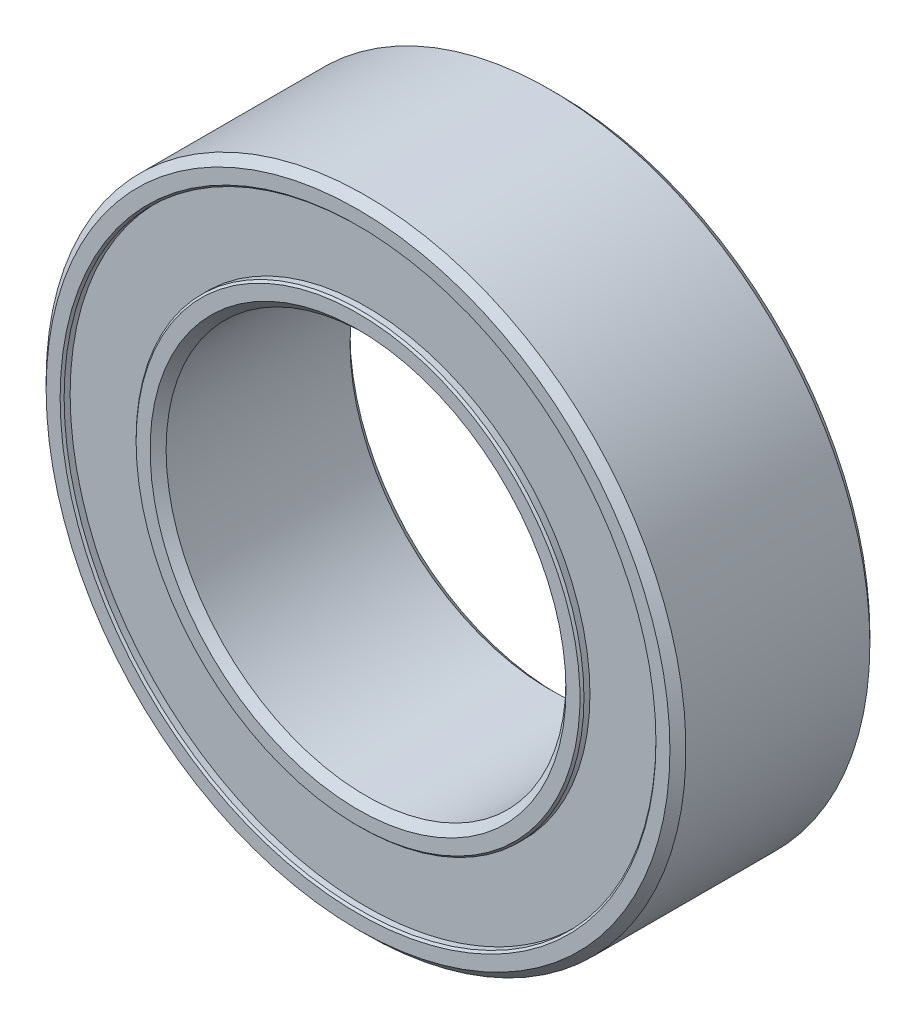
ISO-10303-21;
HEADER;
FILE_DESCRIPTION(('STEP AP214'),'2;1');
FILE_NAME('part.step','',(''),(''),'','','');
FILE_SCHEMA(('AUTOMOTIVE_DESIGN { 1 0 10303 214 1 1 1 1 }'));
ENDSEC;
DATA;
#1=APPLICATION_CONTEXT('core data for automotive mechanical design processes');
#2=APPLICATION_PROTOCOL_DEFINITION('international standard','automotive_design',2000,#1);
#3=PRODUCT_CONTEXT('',#1,'mechanical');
#4=PRODUCT('Part','Part','',(#3));
#5=PRODUCT_RELATED_PRODUCT_CATEGORY('part','',(#4));
#6=PRODUCT_DEFINITION_FORMATION('','',#4);
#7=PRODUCT_DEFINITION_CONTEXT('part definition',#1,'design');
#8=PRODUCT_DEFINITION('design','',#6,#7);
#9=PRODUCT_DEFINITION_SHAPE('','',#8);
#10=(LENGTH_UNIT() NAMED_UNIT(*) SI_UNIT(.MILLI.,.METRE.));
#11=(NAMED_UNIT(*) PLANE_ANGLE_UNIT() SI_UNIT($,.RADIAN.));
#12=(NAMED_UNIT(*) SI_UNIT($,.STERADIAN.) SOLID_ANGLE_UNIT());
#13=UNCERTAINTY_MEASURE_WITH_UNIT(LENGTH_MEASURE(1.E-05),#10,'distance_accuracy_value','');
#14=(GEOMETRIC_REPRESENTATION_CONTEXT(3) GLOBAL_UNCERTAINTY_ASSIGNED_CONTEXT((#13)) GLOBAL_UNIT_ASSIGNED_CONTEXT((#10,
#11,#12)) REPRESENTATION_CONTEXT('',''));
#15=CARTESIAN_POINT('',(0.,0.,0.));
#16=DIRECTION('',(0.,0.,1.));
#17=DIRECTION('',(1.,0.,0.));
#18=AXIS2_PLACEMENT_3D('',#15,#16,#17);
#19=CARTESIAN_POINT('',(0.,0.,1.15));
#20=DIRECTION('',(0.,0.,-1.));
#21=DIRECTION('',(-1.,0.,0.));
#22=AXIS2_PLACEMENT_3D('',#19,#20,#21);
#23=CYLINDRICAL_SURFACE('',#22,2.8);
#24=CARTESIAN_POINT('',(0.,0.,-1.15));
#25=DIRECTION('',(0.,0.,-1.));
#26=DIRECTION('',(-1.,0.,0.));
#27=AXIS2_PLACEMENT_3D('',#24,#25,#26);
#28=CIRCLE('',#27,2.8);
#29=CARTESIAN_POINT('',(-2.8,0.,-1.15));
#30=VERTEX_POINT('',#29);
#31=EDGE_CURVE('P0_E26',#30,#30,#28,.T.);
#32=ORIENTED_EDGE('',*,*,#31,.T.);
#33=EDGE_LOOP('',(#32));
#34=FACE_BOUND('',#33,.T.);
#35=CARTESIAN_POINT('',(0.,0.,1.15));
#36=DIRECTION('',(0.,0.,-1.));
#37=DIRECTION('',(-1.,0.,0.));
#38=AXIS2_PLACEMENT_3D('',#35,#36,#37);
#39=CIRCLE('',#38,2.8);
#40=CARTESIAN_POINT('',(-2.8,0.,1.15));
#41=VERTEX_POINT('',#40);
#42=EDGE_CURVE('P0_E17',#41,#41,#39,.T.);
#43=ORIENTED_EDGE('',*,*,#42,.F.);
#44=EDGE_LOOP('',(#43));
#45=FACE_BOUND('',#44,.T.);
#46=ADVANCED_FACE('P0_F14',(#34,#45),#23,.F.);
#47=CARTESIAN_POINT('',(0.,0.,1.15));
#48=DIRECTION('',(0.,0.,1.));
#49=DIRECTION('',(1.,0.,0.));
#50=AXIS2_PLACEMENT_3D('',#47,#48,#49);
#51=PLANE('',#50);
#52=CARTESIAN_POINT('',(0.,0.,1.15));
#53=DIRECTION('',(0.,0.,-1.));
#54=DIRECTION('',(-1.,0.,0.));
#55=AXIS2_PLACEMENT_3D('',#52,#53,#54);
#56=CIRCLE('',#55,3.7);
#57=CARTESIAN_POINT('',(-3.7,0.,1.15));
#58=VERTEX_POINT('',#57);
#59=EDGE_CURVE('P0_E21',#58,#58,#56,.T.);
#60=ORIENTED_EDGE('',*,*,#59,.F.);
#61=EDGE_LOOP('',(#60));
#62=FACE_BOUND('',#61,.T.);
#63=ORIENTED_EDGE('',*,*,#42,.T.);
#64=EDGE_LOOP('',(#63));
#65=FACE_BOUND('',#64,.T.);
#66=ADVANCED_FACE('P0_F34',(#62,#65),#51,.T.);
#67=CARTESIAN_POINT('',(0.,0.,-1.15));
#68=DIRECTION('',(0.,0.,1.));
#69=DIRECTION('',(1.,0.,0.));
#70=AXIS2_PLACEMENT_3D('',#67,#68,#69);
#71=PLANE('',#70);
#72=CARTESIAN_POINT('',(0.,0.,-1.15));
#73=DIRECTION('',(0.,0.,-1.));
#74=DIRECTION('',(-1.,0.,0.));
#75=AXIS2_PLACEMENT_3D('',#72,#73,#74);
#76=CIRCLE('',#75,3.7);
#77=CARTESIAN_POINT('',(-3.7,0.,-1.15));
#78=VERTEX_POINT('',#77);
#79=EDGE_CURVE('P0_E10',#78,#78,#76,.F.);
#80=ORIENTED_EDGE('',*,*,#79,.F.);
#81=EDGE_LOOP('',(#80));
#82=FACE_BOUND('',#81,.T.);
#83=ORIENTED_EDGE('',*,*,#31,.F.);
#84=EDGE_LOOP('',(#83));
#85=FACE_BOUND('',#84,.T.);
#86=ADVANCED_FACE('P0_F41',(#82,#85),#71,.F.);
#87=CARTESIAN_POINT('',(0.,0.,1.15));
#88=DIRECTION('',(0.,0.,-1.));
#89=DIRECTION('',(-1.,0.,0.));
#90=AXIS2_PLACEMENT_3D('',#87,#88,#89);
#91=CYLINDRICAL_SURFACE('',#90,3.7);
#92=ORIENTED_EDGE('',*,*,#79,.T.);
#93=EDGE_LOOP('',(#92));
#94=FACE_BOUND('',#93,.T.);
#95=ORIENTED_EDGE('',*,*,#59,.T.);
#96=EDGE_LOOP('',(#95));
#97=FACE_BOUND('',#96,.T.);
#98=ADVANCED_FACE('P0_F43',(#94,#97),#91,.T.);
#99=CLOSED_SHELL('',(#46,#66,#86,#98));
#100=MANIFOLD_SOLID_BREP('P0_B1',#99);
#101=CARTESIAN_POINT('',(0.,0.,1.25));
#102=DIRECTION('',(0.,0.,-1.));
#103=DIRECTION('',(-1.,0.,0.));
#104=AXIS2_PLACEMENT_3D('',#101,#102,#103);
#105=CYLINDRICAL_SURFACE('',#104,2.5);
#106=CARTESIAN_POINT('',(0.,0.,-1.15000000005239));
#107=DIRECTION('',(0.,0.,-1.));
#108=DIRECTION('',(-1.,0.,0.));
#109=AXIS2_PLACEMENT_3D('',#106,#107,#108);
#110=CIRCLE('',#109,2.49999999999772);
#111=CARTESIAN_POINT('',(-2.49999999999772,0.,-1.15000000005239));
#112=VERTEX_POINT('',#111);
#113=EDGE_CURVE('P1_E29',#112,#112,#110,.T.);
#114=ORIENTED_EDGE('',*,*,#113,.T.);
#115=EDGE_LOOP('',(#114));
#116=FACE_BOUND('',#115,.T.);
#117=CARTESIAN_POINT('',(0.,0.,1.15000000005239));
#118=DIRECTION('',(0.,0.,1.));
#119=DIRECTION('',(1.,0.,0.));
#120=AXIS2_PLACEMENT_3D('',#117,#118,#119);
#121=CIRCLE('',#120,2.49999999999772);
#122=CARTESIAN_POINT('',(2.49999999999772,0.,1.15000000005239));
#123=VERTEX_POINT('',#122);
#124=EDGE_CURVE('P1_E32',#123,#123,#121,.T.);
#125=ORIENTED_EDGE('',*,*,#124,.T.);
#126=EDGE_LOOP('',(#125));
#127=FACE_BOUND('',#126,.T.);
#128=ADVANCED_FACE('P1_F14',(#116,#127),#105,.F.);
#129=CARTESIAN_POINT('',(0.,0.,1.25000000014097));
#130=DIRECTION('',(0.,0.,1.));
#131=DIRECTION('',(1.,0.,0.));
#132=AXIS2_PLACEMENT_3D('',#129,#130,#131);
#133=CONICAL_SURFACE('',#132,2.60000000008631,0.785398163397448);
#134=ORIENTED_EDGE('',*,*,#124,.F.);
#135=EDGE_LOOP('',(#134));
#136=FACE_BOUND('',#135,.T.);
#137=CARTESIAN_POINT('',(0.,0.,1.25000000008413));
#138=DIRECTION('',(0.,0.,1.));
#139=DIRECTION('',(1.,0.,0.));
#140=AXIS2_PLACEMENT_3D('',#137,#138,#139);
#141=CIRCLE('',#140,2.60000000002947);
#142=CARTESIAN_POINT('',(2.60000000002947,0.,1.25000000008413));
#143=VERTEX_POINT('',#142);
#144=EDGE_CURVE('P1_E17',#143,#143,#141,.F.);
#145=ORIENTED_EDGE('',*,*,#144,.F.);
#146=EDGE_LOOP('',(#145));
#147=FACE_BOUND('',#146,.T.);
#148=ADVANCED_FACE('P1_F48',(#136,#147),#133,.F.);
#149=CARTESIAN_POINT('',(0.,0.,-1.25000000002728));
#150=DIRECTION('',(0.,0.,-1.));
#151=DIRECTION('',(-1.,0.,0.));
#152=AXIS2_PLACEMENT_3D('',#149,#150,#151);
#153=CONICAL_SURFACE('',#152,2.59999999991578,0.785398163113232);
#154=CARTESIAN_POINT('',(0.,0.,-1.25000000002728));
#155=DIRECTION('',(0.,0.,-1.));
#156=DIRECTION('',(-1.,0.,0.));
#157=AXIS2_PLACEMENT_3D('',#154,#155,#156);
#158=CIRCLE('',#157,2.59999999991578);
#159=CARTESIAN_POINT('',(-2.59999999991578,0.,-1.25000000002728));
#160=VERTEX_POINT('',#159);
#161=EDGE_CURVE('P1_E39',#160,#160,#158,.T.);
#162=ORIENTED_EDGE('',*,*,#161,.T.);
#163=EDGE_LOOP('',(#162));
#164=FACE_BOUND('',#163,.T.);
#165=ORIENTED_EDGE('',*,*,#113,.F.);
#166=EDGE_LOOP('',(#165));
#167=FACE_BOUND('',#166,.T.);
#168=ADVANCED_FACE('P1_F50',(#164,#167),#153,.F.);
#169=CARTESIAN_POINT('',(0.,0.,1.25));
#170=DIRECTION('',(0.,0.,1.));
#171=DIRECTION('',(1.,0.,0.));
#172=AXIS2_PLACEMENT_3D('',#169,#170,#171);
#173=PLANE('',#172);
#174=CARTESIAN_POINT('',(0.,0.,1.24999999997044));
#175=DIRECTION('',(0.,0.,-1.));
#176=DIRECTION('',(-1.,0.,0.));
#177=AXIS2_PLACEMENT_3D('',#174,#175,#176);
#178=CIRCLE('',#177,2.77499999998554);
#179=CARTESIAN_POINT('',(-2.77499999998554,0.,1.24999999997044));
#180=VERTEX_POINT('',#179);
#181=EDGE_CURVE('P1_E37',#180,#180,#178,.T.);
#182=ORIENTED_EDGE('',*,*,#181,.F.);
#183=EDGE_LOOP('',(#182));
#184=FACE_BOUND('',#183,.T.);
#185=ORIENTED_EDGE('',*,*,#144,.T.);
#186=EDGE_LOOP('',(#185));
#187=FACE_BOUND('',#186,.T.);
#188=ADVANCED_FACE('P1_F46',(#184,#187),#173,.T.);
#189=CARTESIAN_POINT('',(0.,0.,-1.25));
#190=DIRECTION('',(0.,0.,1.));
#191=DIRECTION('',(1.,0.,0.));
#192=AXIS2_PLACEMENT_3D('',#189,#190,#191);
#193=PLANE('',#192);
#194=CARTESIAN_POINT('',(0.,0.,-1.24999999997044));
#195=DIRECTION('',(0.,0.,1.));
#196=DIRECTION('',(1.,0.,0.));
#197=AXIS2_PLACEMENT_3D('',#194,#195,#196);
#198=CIRCLE('',#197,2.77499999998554);
#199=CARTESIAN_POINT('',(2.77499999998554,0.,-1.24999999997044));
#200=VERTEX_POINT('',#199);
#201=EDGE_CURVE('P1_E26',#200,#200,#198,.T.);
#202=ORIENTED_EDGE('',*,*,#201,.F.);
#203=EDGE_LOOP('',(#202));
#204=FACE_BOUND('',#203,.T.);
#205=ORIENTED_EDGE('',*,*,#161,.F.);
#206=EDGE_LOOP('',(#205));
#207=FACE_BOUND('',#206,.T.);
#208=ADVANCED_FACE('P1_F74',(#204,#207),#193,.F.);
#209=CARTESIAN_POINT('',(0.,0.,1.22499999991987));
#210=DIRECTION('',(0.,0.,-1.));
#211=DIRECTION('',(-1.,0.,0.));
#212=AXIS2_PLACEMENT_3D('',#209,#210,#211);
#213=CONICAL_SURFACE('',#212,2.8000000000361,0.785398163397448);
#214=CARTESIAN_POINT('',(0.,0.,1.225));
#215=DIRECTION('',(0.,0.,-1.));
#216=DIRECTION('',(-1.,0.,0.));
#217=AXIS2_PLACEMENT_3D('',#214,#215,#216);
#218=CIRCLE('',#217,2.8);
#219=CARTESIAN_POINT('',(-2.8,0.,1.225));
#220=VERTEX_POINT('',#219);
#221=EDGE_CURVE('P1_E21',#220,#220,#218,.T.);
#222=ORIENTED_EDGE('',*,*,#221,.F.);
#223=EDGE_LOOP('',(#222));
#224=FACE_BOUND('',#223,.T.);
#225=ORIENTED_EDGE('',*,*,#181,.T.);
#226=EDGE_LOOP('',(#225));
#227=FACE_BOUND('',#226,.T.);
#228=ADVANCED_FACE('P1_F67',(#224,#227),#213,.T.);
#229=CARTESIAN_POINT('',(0.,0.,-1.22499999991987));
#230=DIRECTION('',(0.,0.,1.));
#231=DIRECTION('',(1.,0.,0.));
#232=AXIS2_PLACEMENT_3D('',#229,#230,#231);
#233=CONICAL_SURFACE('',#232,2.80000000009295,0.785398164534317);
#234=CARTESIAN_POINT('',(0.,0.,-1.225));
#235=DIRECTION('',(0.,0.,-1.));
#236=DIRECTION('',(-1.,0.,0.));
#237=AXIS2_PLACEMENT_3D('',#234,#235,#236);
#238=CIRCLE('',#237,2.8);
#239=CARTESIAN_POINT('',(-2.8,0.,-1.225));
#240=VERTEX_POINT('',#239);
#241=EDGE_CURVE('P1_E10',#240,#240,#238,.F.);
#242=ORIENTED_EDGE('',*,*,#241,.F.);
#243=EDGE_LOOP('',(#242));
#244=FACE_BOUND('',#243,.T.);
#245=ORIENTED_EDGE('',*,*,#201,.T.);
#246=EDGE_LOOP('',(#245));
#247=FACE_BOUND('',#246,.T.);
#248=ADVANCED_FACE('P1_F62',(#244,#247),#233,.T.);
#249=CARTESIAN_POINT('',(0.,0.,1.25));
#250=DIRECTION('',(0.,0.,-1.));
#251=DIRECTION('',(-1.,0.,0.));
#252=AXIS2_PLACEMENT_3D('',#249,#250,#251);
#253=CYLINDRICAL_SURFACE('',#252,2.8);
#254=ORIENTED_EDGE('',*,*,#241,.T.);
#255=EDGE_LOOP('',(#254));
#256=FACE_BOUND('',#255,.T.);
#257=ORIENTED_EDGE('',*,*,#221,.T.);
#258=EDGE_LOOP('',(#257));
#259=FACE_BOUND('',#258,.T.);
#260=ADVANCED_FACE('P1_F60',(#256,#259),#253,.T.);
#261=CLOSED_SHELL('',(#128,#148,#168,#188,#208,#228,#248,#260));
#262=MANIFOLD_SOLID_BREP('P1_B1',#261);
#263=CARTESIAN_POINT('',(0.,0.,1.25000000002728));
#264=DIRECTION('',(0.,0.,1.));
#265=DIRECTION('',(1.,0.,0.));
#266=AXIS2_PLACEMENT_3D('',#263,#264,#265);
#267=CONICAL_SURFACE('',#266,3.72500000008813,0.785398164534317);
#268=CARTESIAN_POINT('',(0.,0.,1.225));
#269=DIRECTION('',(0.,0.,-1.));
#270=DIRECTION('',(-1.,0.,0.));
#271=AXIS2_PLACEMENT_3D('',#268,#269,#270);
#272=CIRCLE('',#271,3.7);
#273=CARTESIAN_POINT('',(-3.7,0.,1.225));
#274=VERTEX_POINT('',#273);
#275=EDGE_CURVE('P2_E29',#274,#274,#272,.T.);
#276=ORIENTED_EDGE('',*,*,#275,.T.);
#277=EDGE_LOOP('',(#276));
#278=FACE_BOUND('',#277,.T.);
#279=CARTESIAN_POINT('',(0.,0.,1.2499999999136));
#280=DIRECTION('',(0.,0.,1.));
#281=DIRECTION('',(1.,0.,0.));
#282=AXIS2_PLACEMENT_3D('',#279,#280,#281);
#283=CIRCLE('',#282,3.72499999997444);
#284=CARTESIAN_POINT('',(3.72499999997444,0.,1.2499999999136));
#285=VERTEX_POINT('',#284);
#286=EDGE_CURVE('P2_E17',#285,#285,#283,.F.);
#287=ORIENTED_EDGE('',*,*,#286,.F.);
#288=EDGE_LOOP('',(#287));
#289=FACE_BOUND('',#288,.T.);
#290=ADVANCED_FACE('P2_F14',(#278,#289),#267,.F.);
#291=CARTESIAN_POINT('',(0.,0.,1.25));
#292=DIRECTION('',(0.,0.,-1.));
#293=DIRECTION('',(-1.,0.,0.));
#294=AXIS2_PLACEMENT_3D('',#291,#292,#293);
#295=CYLINDRICAL_SURFACE('',#294,3.7);
#296=CARTESIAN_POINT('',(0.,0.,-1.25));
#297=DIRECTION('',(0.,0.,-1.));
#298=DIRECTION('',(-1.,0.,0.));
#299=AXIS2_PLACEMENT_3D('',#296,#297,#298);
#300=CIRCLE('',#299,3.7);
#301=CARTESIAN_POINT('',(-3.7,0.,-1.25));
#302=VERTEX_POINT('',#301);
#303=EDGE_CURVE('P2_E36',#302,#302,#300,.T.);
#304=ORIENTED_EDGE('',*,*,#303,.T.);
#305=EDGE_LOOP('',(#304));
#306=FACE_BOUND('',#305,.T.);
#307=ORIENTED_EDGE('',*,*,#275,.F.);
#308=EDGE_LOOP('',(#307));
#309=FACE_BOUND('',#308,.T.);
#310=ADVANCED_FACE('P2_F46',(#306,#309),#295,.F.);
#311=CARTESIAN_POINT('',(0.,0.,1.25));
#312=DIRECTION('',(0.,0.,1.));
#313=DIRECTION('',(1.,0.,0.));
#314=AXIS2_PLACEMENT_3D('',#311,#312,#313);
#315=PLANE('',#314);
#316=CARTESIAN_POINT('',(0.,0.,1.24999999997044));
#317=DIRECTION('',(0.,0.,-1.));
#318=DIRECTION('',(-1.,0.,0.));
#319=AXIS2_PLACEMENT_3D('',#316,#317,#318);
#320=CIRCLE('',#319,3.90000000010104);
#321=CARTESIAN_POINT('',(-3.90000000010104,0.,1.24999999997044));
#322=VERTEX_POINT('',#321);
#323=EDGE_CURVE('P2_E34',#322,#322,#320,.T.);
#324=ORIENTED_EDGE('',*,*,#323,.F.);
#325=EDGE_LOOP('',(#324));
#326=FACE_BOUND('',#325,.T.);
#327=ORIENTED_EDGE('',*,*,#286,.T.);
#328=EDGE_LOOP('',(#327));
#329=FACE_BOUND('',#328,.T.);
#330=ADVANCED_FACE('P2_F43',(#326,#329),#315,.T.);
#331=CARTESIAN_POINT('',(0.,0.,-1.25));
#332=DIRECTION('',(0.,0.,1.));
#333=DIRECTION('',(1.,0.,0.));
#334=AXIS2_PLACEMENT_3D('',#331,#332,#333);
#335=PLANE('',#334);
#336=ORIENTED_EDGE('',*,*,#303,.F.);
#337=EDGE_LOOP('',(#336));
#338=FACE_BOUND('',#337,.T.);
#339=CARTESIAN_POINT('',(0.,0.,-1.25000000002728));
#340=DIRECTION('',(0.,0.,1.));
#341=DIRECTION('',(1.,0.,0.));
#342=AXIS2_PLACEMENT_3D('',#339,#340,#341);
#343=CIRCLE('',#342,3.89999999998736);
#344=CARTESIAN_POINT('',(3.89999999998736,0.,-1.25000000002728));
#345=VERTEX_POINT('',#344);
#346=EDGE_CURVE('P2_E26',#345,#345,#343,.T.);
#347=ORIENTED_EDGE('',*,*,#346,.F.);
#348=EDGE_LOOP('',(#347));
#349=FACE_BOUND('',#348,.T.);
#350=ADVANCED_FACE('P2_F66',(#338,#349),#335,.F.);
#351=CARTESIAN_POINT('',(0.,0.,1.15000000005239));
#352=DIRECTION('',(0.,0.,-1.));
#353=DIRECTION('',(-1.,0.,0.));
#354=AXIS2_PLACEMENT_3D('',#351,#352,#353);
#355=CONICAL_SURFACE('',#354,4.0000000000191,0.785398163397448);
#356=CARTESIAN_POINT('',(0.,0.,1.15));
#357=DIRECTION('',(0.,0.,-1.));
#358=DIRECTION('',(-1.,0.,0.));
#359=AXIS2_PLACEMENT_3D('',#356,#357,#358);
#360=CIRCLE('',#359,4.);
#361=CARTESIAN_POINT('',(-4.,0.,1.15));
#362=VERTEX_POINT('',#361);
#363=EDGE_CURVE('P2_E21',#362,#362,#360,.T.);
#364=ORIENTED_EDGE('',*,*,#363,.F.);
#365=EDGE_LOOP('',(#364));
#366=FACE_BOUND('',#365,.T.);
#367=ORIENTED_EDGE('',*,*,#323,.T.);
#368=EDGE_LOOP('',(#367));
#369=FACE_BOUND('',#368,.T.);
#370=ADVANCED_FACE('P2_F59',(#366,#369),#355,.T.);
#371=CARTESIAN_POINT('',(0.,0.,-1.15000000016607));
#372=DIRECTION('',(0.,0.,1.));
#373=DIRECTION('',(1.,0.,0.));
#374=AXIS2_PLACEMENT_3D('',#371,#372,#373);
#375=CONICAL_SURFACE('',#374,3.99999999984857,0.785398163397448);
#376=CARTESIAN_POINT('',(0.,0.,-1.15));
#377=DIRECTION('',(0.,0.,-1.));
#378=DIRECTION('',(-1.,0.,0.));
#379=AXIS2_PLACEMENT_3D('',#376,#377,#378);
#380=CIRCLE('',#379,4.);
#381=CARTESIAN_POINT('',(-4.,0.,-1.15));
#382=VERTEX_POINT('',#381);
#383=EDGE_CURVE('P2_E10',#382,#382,#380,.F.);
#384=ORIENTED_EDGE('',*,*,#383,.F.);
#385=EDGE_LOOP('',(#384));
#386=FACE_BOUND('',#385,.T.);
#387=ORIENTED_EDGE('',*,*,#346,.T.);
#388=EDGE_LOOP('',(#387));
#389=FACE_BOUND('',#388,.T.);
#390=ADVANCED_FACE('P2_F54',(#386,#389),#375,.T.);
#391=CARTESIAN_POINT('',(0.,0.,1.25));
#392=DIRECTION('',(0.,0.,-1.));
#393=DIRECTION('',(-1.,0.,0.));
#394=AXIS2_PLACEMENT_3D('',#391,#392,#393);
#395=CYLINDRICAL_SURFACE('',#394,4.);
#396=ORIENTED_EDGE('',*,*,#383,.T.);
#397=EDGE_LOOP('',(#396));
#398=FACE_BOUND('',#397,.T.);
#399=ORIENTED_EDGE('',*,*,#363,.T.);
#400=EDGE_LOOP('',(#399));
#401=FACE_BOUND('',#400,.T.);
#402=ADVANCED_FACE('P2_F52',(#398,#401),#395,.T.);
#403=CLOSED_SHELL('',(#290,#310,#330,#350,#370,#390,#402));
#404=MANIFOLD_SOLID_BREP('P2_B1',#403);
#405=ADVANCED_BREP_SHAPE_REPRESENTATION('',(#18,#100,#262,#404),#14);
#406=SHAPE_DEFINITION_REPRESENTATION(#9,#405);
ENDSEC;
END-ISO-10303-21;
